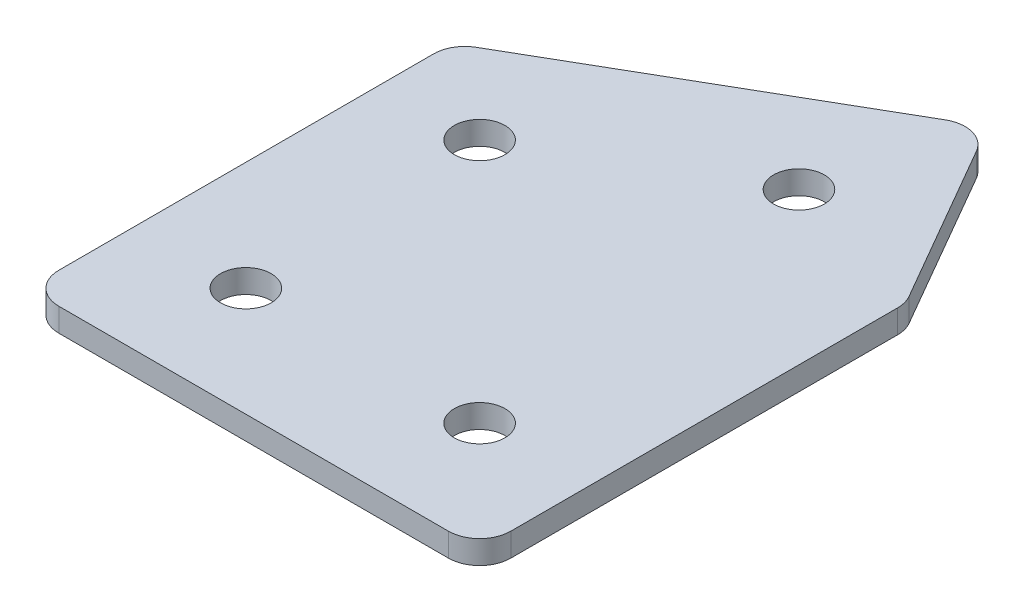
ISO-10303-21;
HEADER;
FILE_DESCRIPTION(('STEP AP214'),'2;1');
FILE_NAME('part.step','',(''),(''),'','','');
FILE_SCHEMA(('AUTOMOTIVE_DESIGN { 1 0 10303 214 1 1 1 1 }'));
ENDSEC;
DATA;
#1=APPLICATION_CONTEXT('core data for automotive mechanical design processes');
#2=APPLICATION_PROTOCOL_DEFINITION('international standard','automotive_design',2000,#1);
#3=PRODUCT_CONTEXT('',#1,'mechanical');
#4=PRODUCT('Part','Part','',(#3));
#5=PRODUCT_RELATED_PRODUCT_CATEGORY('part','',(#4));
#6=PRODUCT_DEFINITION_FORMATION('','',#4);
#7=PRODUCT_DEFINITION_CONTEXT('part definition',#1,'design');
#8=PRODUCT_DEFINITION('design','',#6,#7);
#9=PRODUCT_DEFINITION_SHAPE('','',#8);
#10=(LENGTH_UNIT() NAMED_UNIT(*) SI_UNIT(.MILLI.,.METRE.));
#11=(NAMED_UNIT(*) PLANE_ANGLE_UNIT() SI_UNIT($,.RADIAN.));
#12=(NAMED_UNIT(*) SI_UNIT($,.STERADIAN.) SOLID_ANGLE_UNIT());
#13=UNCERTAINTY_MEASURE_WITH_UNIT(LENGTH_MEASURE(1.E-05),#10,'distance_accuracy_value','');
#14=(GEOMETRIC_REPRESENTATION_CONTEXT(3) GLOBAL_UNCERTAINTY_ASSIGNED_CONTEXT((#13)) GLOBAL_UNIT_ASSIGNED_CONTEXT((#10,
#11,#12)) REPRESENTATION_CONTEXT('',''));
#15=CARTESIAN_POINT('',(0.,0.,0.));
#16=DIRECTION('',(0.,0.,1.));
#17=DIRECTION('',(1.,0.,0.));
#18=AXIS2_PLACEMENT_3D('',#15,#16,#17);
#19=CARTESIAN_POINT('',(-36.6479871876727,1.74134831028641,11.1995120037164));
#20=DIRECTION('',(0.,1.,0.));
#21=DIRECTION('',(0.,0.,1.));
#22=AXIS2_PLACEMENT_3D('',#19,#20,#21);
#23=PLANE('',#22);
#24=CARTESIAN_POINT('',(6.34239386909713,1.74134831028641,11.1995120037164));
#25=DIRECTION('',(0.,1.,0.));
#26=DIRECTION('',(0.,0.,1.));
#27=AXIS2_PLACEMENT_3D('',#24,#25,#26);
#28=CIRCLE('',#27,1.625);
#29=CARTESIAN_POINT('',(6.34239386909713,1.74134831028641,12.8245120037164));
#30=VERTEX_POINT('',#29);
#31=EDGE_CURVE('E201',#30,#30,#28,.T.);
#32=ORIENTED_EDGE('',*,*,#31,.T.);
#33=EDGE_LOOP('',(#32));
#34=FACE_BOUND('',#33,.T.);
#35=CARTESIAN_POINT('',(3.59720334071367,1.74134831028641,-12.0360595814336));
#36=DIRECTION('',(0.,1.,0.));
#37=DIRECTION('',(0.,0.,1.));
#38=AXIS2_PLACEMENT_3D('',#35,#36,#37);
#39=CIRCLE('',#38,1.625);
#40=CARTESIAN_POINT('',(3.59720334071367,1.74134831028641,-10.4110595814336));
#41=VERTEX_POINT('',#40);
#42=EDGE_CURVE('E195',#41,#41,#39,.T.);
#43=ORIENTED_EDGE('',*,*,#42,.T.);
#44=EDGE_LOOP('',(#43));
#45=FACE_BOUND('',#44,.T.);
#46=CARTESIAN_POINT('',(-9.39317771605291,1.74134831028641,-4.53605958143359));
#47=DIRECTION('',(0.,1.,0.));
#48=DIRECTION('',(0.,0.,1.));
#49=AXIS2_PLACEMENT_3D('',#46,#47,#48);
#50=CIRCLE('',#49,1.625);
#51=CARTESIAN_POINT('',(-9.39317771605291,1.74134831028641,-2.91105958143359));
#52=VERTEX_POINT('',#51);
#53=EDGE_CURVE('E189',#52,#52,#50,.T.);
#54=ORIENTED_EDGE('',*,*,#53,.T.);
#55=EDGE_LOOP('',(#54));
#56=FACE_BOUND('',#55,.T.);
#57=CARTESIAN_POINT('',(-8.65760613090287,1.74134831028641,11.1995120037164));
#58=DIRECTION('',(0.,1.,0.));
#59=DIRECTION('',(0.,0.,1.));
#60=AXIS2_PLACEMENT_3D('',#57,#58,#59);
#61=CIRCLE('',#60,1.625);
#62=CARTESIAN_POINT('',(-8.65760613090287,1.74134831028641,12.8245120037164));
#63=VERTEX_POINT('',#62);
#64=EDGE_CURVE('E115',#63,#63,#61,.T.);
#65=ORIENTED_EDGE('',*,*,#64,.T.);
#66=EDGE_LOOP('',(#65));
#67=FACE_BOUND('',#66,.T.);
#68=DIRECTION('',(0.,0.,1.));
#69=VECTOR('',#68,1.);
#70=CARTESIAN_POINT('',(-15.6576061309029,1.74134831028641,-9.00219391845596));
#71=LINE('',#70,#69);
#72=CARTESIAN_POINT('',(-15.6576061309029,1.74134831028641,-7.84749338007671));
#73=VERTEX_POINT('',#72);
#74=CARTESIAN_POINT('',(-15.6576061309029,1.74134831028641,16.1995120037166));
#75=VERTEX_POINT('',#74);
#76=EDGE_CURVE('E182',#73,#75,#71,.T.);
#77=ORIENTED_EDGE('',*,*,#76,.F.);
#78=CARTESIAN_POINT('',(-13.6576061309029,1.74134831028641,-7.84749338007671));
#79=DIRECTION('',(0.,1.,0.));
#80=DIRECTION('',(0.,0.,1.));
#81=AXIS2_PLACEMENT_3D('',#78,#79,#80);
#82=CIRCLE('',#81,2.);
#83=CARTESIAN_POINT('',(-14.6576061309029,1.74134831028641,-9.57954418764558));
#84=VERTEX_POINT('',#83);
#85=EDGE_CURVE('E146',#73,#84,#82,.F.);
#86=ORIENTED_EDGE('',*,*,#85,.T.);
#87=DIRECTION('',(-0.866025403784439,0.,0.499999999999999));
#88=VECTOR('',#87,1.);
#89=CARTESIAN_POINT('',(6.15938116720461,1.74134831028641,-21.5982374079249));
#90=LINE('',#89,#88);
#91=CARTESIAN_POINT('',(4.42733035963573,1.74134831028641,-20.5982374079249));
#92=VERTEX_POINT('',#91);
#93=EDGE_CURVE('E174',#92,#84,#90,.T.);
#94=ORIENTED_EDGE('',*,*,#93,.F.);
#95=CARTESIAN_POINT('',(5.42733035963573,1.74134831028641,-18.8661866003561));
#96=DIRECTION('',(0.,1.,0.));
#97=DIRECTION('',(0.,0.,1.));
#98=AXIS2_PLACEMENT_3D('',#95,#96,#97);
#99=CIRCLE('',#98,2.);
#100=CARTESIAN_POINT('',(7.15938116720461,1.74134831028641,-19.8661866003561));
#101=VERTEX_POINT('',#100);
#102=EDGE_CURVE('E118',#92,#101,#99,.F.);
#103=ORIENTED_EDGE('',*,*,#102,.T.);
#104=DIRECTION('',(-0.499999999999999,0.,-0.866025403784439));
#105=VECTOR('',#104,1.);
#106=CARTESIAN_POINT('',(13.3423938690971,1.74134831028641,-9.15689445683448));
#107=LINE('',#106,#105);
#108=CARTESIAN_POINT('',(13.074444676666,1.74134831028641,-9.62099607197223));
#109=VERTEX_POINT('',#108);
#110=EDGE_CURVE('E119',#109,#101,#107,.T.);
#111=ORIENTED_EDGE('',*,*,#110,.F.);
#112=CARTESIAN_POINT('',(11.3423938690971,1.74134831028641,-8.62099607197224));
#113=DIRECTION('',(0.,1.,0.));
#114=DIRECTION('',(0.,0.,1.));
#115=AXIS2_PLACEMENT_3D('',#112,#113,#114);
#116=CIRCLE('',#115,2.);
#117=CARTESIAN_POINT('',(13.3423938690971,1.74134831028641,-8.62099607197224));
#118=VERTEX_POINT('',#117);
#119=EDGE_CURVE('E141',#109,#118,#116,.F.);
#120=ORIENTED_EDGE('',*,*,#119,.T.);
#121=DIRECTION('',(0.,0.,-1.));
#122=VECTOR('',#121,1.);
#123=CARTESIAN_POINT('',(13.3423938690971,1.74134831028641,18.1995120037166));
#124=LINE('',#123,#122);
#125=CARTESIAN_POINT('',(13.3423938690971,1.74134831028641,16.1995120037166));
#126=VERTEX_POINT('',#125);
#127=EDGE_CURVE('E123',#126,#118,#124,.T.);
#128=ORIENTED_EDGE('',*,*,#127,.F.);
#129=CARTESIAN_POINT('',(11.3423938690971,1.74134831028641,16.1995120037166));
#130=DIRECTION('',(0.,1.,0.));
#131=DIRECTION('',(0.,0.,1.));
#132=AXIS2_PLACEMENT_3D('',#129,#130,#131);
#133=CIRCLE('',#132,2.);
#134=CARTESIAN_POINT('',(11.3423938690971,1.74134831028641,18.1995120037166));
#135=VERTEX_POINT('',#134);
#136=EDGE_CURVE('E31',#126,#135,#133,.F.);
#137=ORIENTED_EDGE('',*,*,#136,.T.);
#138=DIRECTION('',(1.,0.,0.));
#139=VECTOR('',#138,1.);
#140=CARTESIAN_POINT('',(-15.6576061309029,1.74134831028641,18.1995120037166));
#141=LINE('',#140,#139);
#142=CARTESIAN_POINT('',(-13.6576061309029,1.74134831028641,18.1995120037166));
#143=VERTEX_POINT('',#142);
#144=EDGE_CURVE('E180',#143,#135,#141,.T.);
#145=ORIENTED_EDGE('',*,*,#144,.F.);
#146=CARTESIAN_POINT('',(-13.6576061309029,1.74134831028641,16.1995120037166));
#147=DIRECTION('',(0.,1.,0.));
#148=DIRECTION('',(0.,0.,1.));
#149=AXIS2_PLACEMENT_3D('',#146,#147,#148);
#150=CIRCLE('',#149,2.);
#151=EDGE_CURVE('E144',#143,#75,#150,.F.);
#152=ORIENTED_EDGE('',*,*,#151,.T.);
#153=EDGE_LOOP('',(#77,#86,#94,#103,#111,#120,#128,#137,#145,#152));
#154=FACE_BOUND('',#153,.T.);
#155=ADVANCED_FACE('F16',(#34,#45,#56,#67,#154),#23,.F.);
#156=CARTESIAN_POINT('',(6.15938116720461,1.74134831028641,-21.5982374079249));
#157=DIRECTION('',(-0.499999999999999,0.,-0.866025403784439));
#158=DIRECTION('',(-0.866025403784439,0.,0.499999999999999));
#159=AXIS2_PLACEMENT_3D('',#156,#157,#158);
#160=PLANE('',#159);
#161=ORIENTED_EDGE('',*,*,#93,.T.);
#162=DIRECTION('',(0.,1.,0.));
#163=VECTOR('',#162,1.);
#164=CARTESIAN_POINT('',(-14.6576061309029,1.74134831028641,-9.57954418764558));
#165=LINE('',#164,#163);
#166=CARTESIAN_POINT('',(-14.6576061309029,3.24134831028641,-9.57954418764558));
#167=VERTEX_POINT('',#166);
#168=EDGE_CURVE('E105',#84,#167,#165,.T.);
#169=ORIENTED_EDGE('',*,*,#168,.T.);
#170=DIRECTION('',(-0.866025403784439,0.,0.499999999999999));
#171=VECTOR('',#170,1.);
#172=CARTESIAN_POINT('',(6.15938116720461,3.24134831028641,-21.5982374079249));
#173=LINE('',#172,#171);
#174=CARTESIAN_POINT('',(4.42733035963573,3.24134831028641,-20.5982374079249));
#175=VERTEX_POINT('',#174);
#176=EDGE_CURVE('E97',#175,#167,#173,.T.);
#177=ORIENTED_EDGE('',*,*,#176,.F.);
#178=DIRECTION('',(0.,1.,0.));
#179=VECTOR('',#178,1.);
#180=CARTESIAN_POINT('',(4.42733035963573,1.74134831028641,-20.5982374079249));
#181=LINE('',#180,#179);
#182=EDGE_CURVE('E111',#175,#92,#181,.F.);
#183=ORIENTED_EDGE('',*,*,#182,.T.);
#184=EDGE_LOOP('',(#161,#169,#177,#183));
#185=FACE_BOUND('',#184,.T.);
#186=ADVANCED_FACE('F110',(#185),#160,.T.);
#187=CARTESIAN_POINT('',(13.3423938690971,1.74134831028641,-9.15689445683448));
#188=DIRECTION('',(0.866025403784439,0.,-0.499999999999999));
#189=DIRECTION('',(-0.499999999999999,0.,-0.866025403784439));
#190=AXIS2_PLACEMENT_3D('',#187,#188,#189);
#191=PLANE('',#190);
#192=DIRECTION('',(-0.499999999999999,0.,-0.866025403784439));
#193=VECTOR('',#192,1.);
#194=CARTESIAN_POINT('',(13.3423938690971,3.24134831028641,-9.15689445683448));
#195=LINE('',#194,#193);
#196=CARTESIAN_POINT('',(13.074444676666,3.24134831028641,-9.62099607197223));
#197=VERTEX_POINT('',#196);
#198=CARTESIAN_POINT('',(7.15938116720461,3.24134831028641,-19.8661866003561));
#199=VERTEX_POINT('',#198);
#200=EDGE_CURVE('E99',#197,#199,#195,.T.);
#201=ORIENTED_EDGE('',*,*,#200,.F.);
#202=DIRECTION('',(0.,1.,0.));
#203=VECTOR('',#202,1.);
#204=CARTESIAN_POINT('',(13.074444676666,1.74134831028641,-9.62099607197223));
#205=LINE('',#204,#203);
#206=EDGE_CURVE('E10',#197,#109,#205,.F.);
#207=ORIENTED_EDGE('',*,*,#206,.T.);
#208=ORIENTED_EDGE('',*,*,#110,.T.);
#209=DIRECTION('',(0.,1.,0.));
#210=VECTOR('',#209,1.);
#211=CARTESIAN_POINT('',(7.15938116720461,1.74134831028641,-19.8661866003561));
#212=LINE('',#211,#210);
#213=EDGE_CURVE('E24',#101,#199,#212,.T.);
#214=ORIENTED_EDGE('',*,*,#213,.T.);
#215=EDGE_LOOP('',(#201,#207,#208,#214));
#216=FACE_BOUND('',#215,.T.);
#217=ADVANCED_FACE('F157',(#216),#191,.T.);
#218=CARTESIAN_POINT('',(13.3423938690971,1.74134831028641,18.1995120037166));
#219=DIRECTION('',(1.,0.,0.));
#220=DIRECTION('',(0.,0.,-1.));
#221=AXIS2_PLACEMENT_3D('',#218,#219,#220);
#222=PLANE('',#221);
#223=DIRECTION('',(0.,0.,-1.));
#224=VECTOR('',#223,1.);
#225=CARTESIAN_POINT('',(13.3423938690971,3.24134831028641,18.1995120037166));
#226=LINE('',#225,#224);
#227=CARTESIAN_POINT('',(13.3423938690971,3.24134831028641,16.1995120037166));
#228=VERTEX_POINT('',#227);
#229=CARTESIAN_POINT('',(13.3423938690971,3.24134831028641,-8.62099607197224));
#230=VERTEX_POINT('',#229);
#231=EDGE_CURVE('E170',#228,#230,#226,.T.);
#232=ORIENTED_EDGE('',*,*,#231,.F.);
#233=DIRECTION('',(0.,1.,0.));
#234=VECTOR('',#233,1.);
#235=CARTESIAN_POINT('',(13.3423938690971,1.74134831028641,16.1995120037166));
#236=LINE('',#235,#234);
#237=EDGE_CURVE('E155',#228,#126,#236,.F.);
#238=ORIENTED_EDGE('',*,*,#237,.T.);
#239=ORIENTED_EDGE('',*,*,#127,.T.);
#240=DIRECTION('',(0.,1.,0.));
#241=VECTOR('',#240,1.);
#242=CARTESIAN_POINT('',(13.3423938690971,1.74134831028641,-8.62099607197224));
#243=LINE('',#242,#241);
#244=EDGE_CURVE('E152',#118,#230,#243,.T.);
#245=ORIENTED_EDGE('',*,*,#244,.T.);
#246=EDGE_LOOP('',(#232,#238,#239,#245));
#247=FACE_BOUND('',#246,.T.);
#248=ADVANCED_FACE('F169',(#247),#222,.T.);
#249=CARTESIAN_POINT('',(-15.6576061309029,1.74134831028641,18.1995120037166));
#250=DIRECTION('',(0.,0.,1.));
#251=DIRECTION('',(1.,0.,0.));
#252=AXIS2_PLACEMENT_3D('',#249,#250,#251);
#253=PLANE('',#252);
#254=DIRECTION('',(1.,0.,0.));
#255=VECTOR('',#254,1.);
#256=CARTESIAN_POINT('',(-15.6576061309029,3.24134831028641,18.1995120037166));
#257=LINE('',#256,#255);
#258=CARTESIAN_POINT('',(-13.6576061309029,3.24134831028641,18.1995120037166));
#259=VERTEX_POINT('',#258);
#260=CARTESIAN_POINT('',(11.3423938690971,3.24134831028641,18.1995120037166));
#261=VERTEX_POINT('',#260);
#262=EDGE_CURVE('E173',#259,#261,#257,.T.);
#263=ORIENTED_EDGE('',*,*,#262,.F.);
#264=DIRECTION('',(0.,1.,0.));
#265=VECTOR('',#264,1.);
#266=CARTESIAN_POINT('',(-13.6576061309029,1.74134831028641,18.1995120037166));
#267=LINE('',#266,#265);
#268=EDGE_CURVE('E38',#259,#143,#267,.F.);
#269=ORIENTED_EDGE('',*,*,#268,.T.);
#270=ORIENTED_EDGE('',*,*,#144,.T.);
#271=DIRECTION('',(0.,1.,0.));
#272=VECTOR('',#271,1.);
#273=CARTESIAN_POINT('',(11.3423938690971,1.74134831028641,18.1995120037166));
#274=LINE('',#273,#272);
#275=EDGE_CURVE('E148',#135,#261,#274,.T.);
#276=ORIENTED_EDGE('',*,*,#275,.T.);
#277=EDGE_LOOP('',(#263,#269,#270,#276));
#278=FACE_BOUND('',#277,.T.);
#279=ADVANCED_FACE('F333',(#278),#253,.T.);
#280=CARTESIAN_POINT('',(-15.6576061309029,1.74134831028641,-9.00219391845596));
#281=DIRECTION('',(-1.,0.,0.));
#282=DIRECTION('',(0.,0.,1.));
#283=AXIS2_PLACEMENT_3D('',#280,#281,#282);
#284=PLANE('',#283);
#285=DIRECTION('',(0.,0.,1.));
#286=VECTOR('',#285,1.);
#287=CARTESIAN_POINT('',(-15.6576061309029,3.24134831028641,-9.00219391845596));
#288=LINE('',#287,#286);
#289=CARTESIAN_POINT('',(-15.6576061309029,3.24134831028641,-7.84749338007671));
#290=VERTEX_POINT('',#289);
#291=CARTESIAN_POINT('',(-15.6576061309029,3.24134831028641,16.1995120037166));
#292=VERTEX_POINT('',#291);
#293=EDGE_CURVE('E114',#290,#292,#288,.T.);
#294=ORIENTED_EDGE('',*,*,#293,.F.);
#295=DIRECTION('',(0.,1.,0.));
#296=VECTOR('',#295,1.);
#297=CARTESIAN_POINT('',(-15.6576061309029,1.74134831028641,-7.84749338007671));
#298=LINE('',#297,#296);
#299=EDGE_CURVE('E138',#290,#73,#298,.F.);
#300=ORIENTED_EDGE('',*,*,#299,.T.);
#301=ORIENTED_EDGE('',*,*,#76,.T.);
#302=DIRECTION('',(0.,1.,0.));
#303=VECTOR('',#302,1.);
#304=CARTESIAN_POINT('',(-15.6576061309029,1.74134831028641,16.1995120037166));
#305=LINE('',#304,#303);
#306=EDGE_CURVE('E135',#75,#292,#305,.T.);
#307=ORIENTED_EDGE('',*,*,#306,.T.);
#308=EDGE_LOOP('',(#294,#300,#301,#307));
#309=FACE_BOUND('',#308,.T.);
#310=ADVANCED_FACE('F223',(#309),#284,.T.);
#311=CARTESIAN_POINT('',(-36.6479871876727,3.24134831028641,11.1995120037164));
#312=DIRECTION('',(0.,1.,0.));
#313=DIRECTION('',(0.,0.,1.));
#314=AXIS2_PLACEMENT_3D('',#311,#312,#313);
#315=PLANE('',#314);
#316=CARTESIAN_POINT('',(6.34239386909713,3.24134831028641,11.1995120037164));
#317=DIRECTION('',(0.,1.,0.));
#318=DIRECTION('',(0.,0.,1.));
#319=AXIS2_PLACEMENT_3D('',#316,#317,#318);
#320=CIRCLE('',#319,1.625);
#321=CARTESIAN_POINT('',(6.34239386909713,3.24134831028641,12.8245120037164));
#322=VERTEX_POINT('',#321);
#323=EDGE_CURVE('E204',#322,#322,#320,.T.);
#324=ORIENTED_EDGE('',*,*,#323,.F.);
#325=EDGE_LOOP('',(#324));
#326=FACE_BOUND('',#325,.T.);
#327=CARTESIAN_POINT('',(3.59720334071367,3.24134831028641,-12.0360595814336));
#328=DIRECTION('',(0.,1.,0.));
#329=DIRECTION('',(0.,0.,1.));
#330=AXIS2_PLACEMENT_3D('',#327,#328,#329);
#331=CIRCLE('',#330,1.625);
#332=CARTESIAN_POINT('',(3.59720334071367,3.24134831028641,-10.4110595814336));
#333=VERTEX_POINT('',#332);
#334=EDGE_CURVE('E198',#333,#333,#331,.T.);
#335=ORIENTED_EDGE('',*,*,#334,.F.);
#336=EDGE_LOOP('',(#335));
#337=FACE_BOUND('',#336,.T.);
#338=CARTESIAN_POINT('',(-9.39317771605291,3.24134831028641,-4.53605958143359));
#339=DIRECTION('',(0.,1.,0.));
#340=DIRECTION('',(0.,0.,1.));
#341=AXIS2_PLACEMENT_3D('',#338,#339,#340);
#342=CIRCLE('',#341,1.625);
#343=CARTESIAN_POINT('',(-9.39317771605291,3.24134831028641,-2.91105958143359));
#344=VERTEX_POINT('',#343);
#345=EDGE_CURVE('E192',#344,#344,#342,.T.);
#346=ORIENTED_EDGE('',*,*,#345,.F.);
#347=EDGE_LOOP('',(#346));
#348=FACE_BOUND('',#347,.T.);
#349=CARTESIAN_POINT('',(-8.65760613090287,3.24134831028641,11.1995120037164));
#350=DIRECTION('',(0.,1.,0.));
#351=DIRECTION('',(0.,0.,1.));
#352=AXIS2_PLACEMENT_3D('',#349,#350,#351);
#353=CIRCLE('',#352,1.625);
#354=CARTESIAN_POINT('',(-8.65760613090287,3.24134831028641,12.8245120037164));
#355=VERTEX_POINT('',#354);
#356=EDGE_CURVE('E186',#355,#355,#353,.T.);
#357=ORIENTED_EDGE('',*,*,#356,.F.);
#358=EDGE_LOOP('',(#357));
#359=FACE_BOUND('',#358,.T.);
#360=ORIENTED_EDGE('',*,*,#176,.T.);
#361=CARTESIAN_POINT('',(-13.6576061309029,3.24134831028641,-7.84749338007671));
#362=DIRECTION('',(0.,1.,0.));
#363=DIRECTION('',(0.,0.,1.));
#364=AXIS2_PLACEMENT_3D('',#361,#362,#363);
#365=CIRCLE('',#364,2.);
#366=EDGE_CURVE('E133',#167,#290,#365,.T.);
#367=ORIENTED_EDGE('',*,*,#366,.T.);
#368=ORIENTED_EDGE('',*,*,#293,.T.);
#369=CARTESIAN_POINT('',(-13.6576061309029,3.24134831028641,16.1995120037166));
#370=DIRECTION('',(0.,1.,0.));
#371=DIRECTION('',(0.,0.,1.));
#372=AXIS2_PLACEMENT_3D('',#369,#370,#371);
#373=CIRCLE('',#372,2.);
#374=EDGE_CURVE('E131',#292,#259,#373,.T.);
#375=ORIENTED_EDGE('',*,*,#374,.T.);
#376=ORIENTED_EDGE('',*,*,#262,.T.);
#377=CARTESIAN_POINT('',(11.3423938690971,3.24134831028641,16.1995120037166));
#378=DIRECTION('',(0.,1.,0.));
#379=DIRECTION('',(0.,0.,1.));
#380=AXIS2_PLACEMENT_3D('',#377,#378,#379);
#381=CIRCLE('',#380,2.);
#382=EDGE_CURVE('E129',#261,#228,#381,.T.);
#383=ORIENTED_EDGE('',*,*,#382,.T.);
#384=ORIENTED_EDGE('',*,*,#231,.T.);
#385=CARTESIAN_POINT('',(11.3423938690971,3.24134831028641,-8.62099607197224));
#386=DIRECTION('',(0.,1.,0.));
#387=DIRECTION('',(0.,0.,1.));
#388=AXIS2_PLACEMENT_3D('',#385,#386,#387);
#389=CIRCLE('',#388,2.);
#390=EDGE_CURVE('E104',#230,#197,#389,.T.);
#391=ORIENTED_EDGE('',*,*,#390,.T.);
#392=ORIENTED_EDGE('',*,*,#200,.T.);
#393=CARTESIAN_POINT('',(5.42733035963573,3.24134831028641,-18.8661866003561));
#394=DIRECTION('',(0.,1.,0.));
#395=DIRECTION('',(0.,0.,1.));
#396=AXIS2_PLACEMENT_3D('',#393,#394,#395);
#397=CIRCLE('',#396,2.);
#398=EDGE_CURVE('E94',#199,#175,#397,.T.);
#399=ORIENTED_EDGE('',*,*,#398,.T.);
#400=EDGE_LOOP('',(#360,#367,#368,#375,#376,#383,#384,#391,#392,#399));
#401=FACE_BOUND('',#400,.T.);
#402=ADVANCED_FACE('F96',(#326,#337,#348,#359,#401),#315,.T.);
#403=CARTESIAN_POINT('',(-8.65760613090287,1.74134831028641,11.1995120037164));
#404=DIRECTION('',(0.,1.,0.));
#405=DIRECTION('',(0.,0.,1.));
#406=AXIS2_PLACEMENT_3D('',#403,#404,#405);
#407=CYLINDRICAL_SURFACE('',#406,1.625);
#408=ORIENTED_EDGE('',*,*,#64,.F.);
#409=EDGE_LOOP('',(#408));
#410=FACE_BOUND('',#409,.T.);
#411=ORIENTED_EDGE('',*,*,#356,.T.);
#412=EDGE_LOOP('',(#411));
#413=FACE_BOUND('',#412,.T.);
#414=ADVANCED_FACE('F222',(#410,#413),#407,.F.);
#415=CARTESIAN_POINT('',(-9.39317771605291,1.74134831028641,-4.53605958143359));
#416=DIRECTION('',(0.,1.,0.));
#417=DIRECTION('',(0.,0.,1.));
#418=AXIS2_PLACEMENT_3D('',#415,#416,#417);
#419=CYLINDRICAL_SURFACE('',#418,1.625);
#420=ORIENTED_EDGE('',*,*,#53,.F.);
#421=EDGE_LOOP('',(#420));
#422=FACE_BOUND('',#421,.T.);
#423=ORIENTED_EDGE('',*,*,#345,.T.);
#424=EDGE_LOOP('',(#423));
#425=FACE_BOUND('',#424,.T.);
#426=ADVANCED_FACE('F232',(#422,#425),#419,.F.);
#427=CARTESIAN_POINT('',(3.59720334071367,1.74134831028641,-12.0360595814336));
#428=DIRECTION('',(0.,1.,0.));
#429=DIRECTION('',(0.,0.,1.));
#430=AXIS2_PLACEMENT_3D('',#427,#428,#429);
#431=CYLINDRICAL_SURFACE('',#430,1.625);
#432=ORIENTED_EDGE('',*,*,#42,.F.);
#433=EDGE_LOOP('',(#432));
#434=FACE_BOUND('',#433,.T.);
#435=ORIENTED_EDGE('',*,*,#334,.T.);
#436=EDGE_LOOP('',(#435));
#437=FACE_BOUND('',#436,.T.);
#438=ADVANCED_FACE('F216',(#434,#437),#431,.F.);
#439=CARTESIAN_POINT('',(6.34239386909713,1.74134831028641,11.1995120037164));
#440=DIRECTION('',(0.,1.,0.));
#441=DIRECTION('',(0.,0.,1.));
#442=AXIS2_PLACEMENT_3D('',#439,#440,#441);
#443=CYLINDRICAL_SURFACE('',#442,1.625);
#444=ORIENTED_EDGE('',*,*,#31,.F.);
#445=EDGE_LOOP('',(#444));
#446=FACE_BOUND('',#445,.T.);
#447=ORIENTED_EDGE('',*,*,#323,.T.);
#448=EDGE_LOOP('',(#447));
#449=FACE_BOUND('',#448,.T.);
#450=ADVANCED_FACE('F212',(#446,#449),#443,.F.);
#451=CARTESIAN_POINT('',(-13.6576061309029,1.74134831028641,-7.84749338007671));
#452=DIRECTION('',(0.,1.,0.));
#453=DIRECTION('',(0.,0.,1.));
#454=AXIS2_PLACEMENT_3D('',#451,#452,#453);
#455=CYLINDRICAL_SURFACE('',#454,2.);
#456=ORIENTED_EDGE('',*,*,#85,.F.);
#457=ORIENTED_EDGE('',*,*,#299,.F.);
#458=ORIENTED_EDGE('',*,*,#366,.F.);
#459=ORIENTED_EDGE('',*,*,#168,.F.);
#460=EDGE_LOOP('',(#456,#457,#458,#459));
#461=FACE_BOUND('',#460,.T.);
#462=ADVANCED_FACE('F215',(#461),#455,.T.);
#463=CARTESIAN_POINT('',(-13.6576061309029,1.74134831028641,16.1995120037166));
#464=DIRECTION('',(0.,1.,0.));
#465=DIRECTION('',(0.,0.,1.));
#466=AXIS2_PLACEMENT_3D('',#463,#464,#465);
#467=CYLINDRICAL_SURFACE('',#466,2.);
#468=ORIENTED_EDGE('',*,*,#151,.F.);
#469=ORIENTED_EDGE('',*,*,#268,.F.);
#470=ORIENTED_EDGE('',*,*,#374,.F.);
#471=ORIENTED_EDGE('',*,*,#306,.F.);
#472=EDGE_LOOP('',(#468,#469,#470,#471));
#473=FACE_BOUND('',#472,.T.);
#474=ADVANCED_FACE('F252',(#473),#467,.T.);
#475=CARTESIAN_POINT('',(11.3423938690971,1.74134831028641,16.1995120037166));
#476=DIRECTION('',(0.,1.,0.));
#477=DIRECTION('',(0.,0.,1.));
#478=AXIS2_PLACEMENT_3D('',#475,#476,#477);
#479=CYLINDRICAL_SURFACE('',#478,2.);
#480=ORIENTED_EDGE('',*,*,#136,.F.);
#481=ORIENTED_EDGE('',*,*,#237,.F.);
#482=ORIENTED_EDGE('',*,*,#382,.F.);
#483=ORIENTED_EDGE('',*,*,#275,.F.);
#484=EDGE_LOOP('',(#480,#481,#482,#483));
#485=FACE_BOUND('',#484,.T.);
#486=ADVANCED_FACE('F256',(#485),#479,.T.);
#487=CARTESIAN_POINT('',(11.3423938690971,1.74134831028641,-8.62099607197224));
#488=DIRECTION('',(0.,1.,0.));
#489=DIRECTION('',(0.,0.,1.));
#490=AXIS2_PLACEMENT_3D('',#487,#488,#489);
#491=CYLINDRICAL_SURFACE('',#490,2.);
#492=ORIENTED_EDGE('',*,*,#119,.F.);
#493=ORIENTED_EDGE('',*,*,#206,.F.);
#494=ORIENTED_EDGE('',*,*,#390,.F.);
#495=ORIENTED_EDGE('',*,*,#244,.F.);
#496=EDGE_LOOP('',(#492,#493,#494,#495));
#497=FACE_BOUND('',#496,.T.);
#498=ADVANCED_FACE('F165',(#497),#491,.T.);
#499=CARTESIAN_POINT('',(5.42733035963573,1.74134831028641,-18.8661866003561));
#500=DIRECTION('',(0.,1.,0.));
#501=DIRECTION('',(0.,0.,1.));
#502=AXIS2_PLACEMENT_3D('',#499,#500,#501);
#503=CYLINDRICAL_SURFACE('',#502,2.);
#504=ORIENTED_EDGE('',*,*,#102,.F.);
#505=ORIENTED_EDGE('',*,*,#182,.F.);
#506=ORIENTED_EDGE('',*,*,#398,.F.);
#507=ORIENTED_EDGE('',*,*,#213,.F.);
#508=EDGE_LOOP('',(#504,#505,#506,#507));
#509=FACE_BOUND('',#508,.T.);
#510=ADVANCED_FACE('F18',(#509),#503,.T.);
#511=CLOSED_SHELL('',(#155,#186,#217,#248,#279,#310,#402,#414,#426,#438,#450,#462,#474,#486,
#498,#510));
#512=MANIFOLD_SOLID_BREP('B1',#511);
#513=ADVANCED_BREP_SHAPE_REPRESENTATION('',(#18,#512),#14);
#514=SHAPE_DEFINITION_REPRESENTATION(#9,#513);
ENDSEC;
END-ISO-10303-21;
